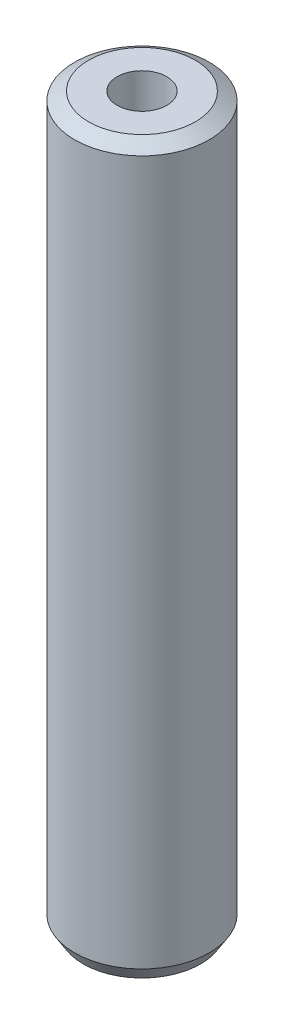
ISO-10303-21;
HEADER;
FILE_DESCRIPTION(('STEP AP214'),'2;1');
FILE_NAME('part.step','',(''),(''),'','','');
FILE_SCHEMA(('AUTOMOTIVE_DESIGN { 1 0 10303 214 1 1 1 1 }'));
ENDSEC;
DATA;
#1=APPLICATION_CONTEXT('core data for automotive mechanical design processes');
#2=APPLICATION_PROTOCOL_DEFINITION('international standard','automotive_design',2000,#1);
#3=PRODUCT_CONTEXT('',#1,'mechanical');
#4=PRODUCT('Part','Part','',(#3));
#5=PRODUCT_RELATED_PRODUCT_CATEGORY('part','',(#4));
#6=PRODUCT_DEFINITION_FORMATION('','',#4);
#7=PRODUCT_DEFINITION_CONTEXT('part definition',#1,'design');
#8=PRODUCT_DEFINITION('design','',#6,#7);
#9=PRODUCT_DEFINITION_SHAPE('','',#8);
#10=(LENGTH_UNIT() NAMED_UNIT(*) SI_UNIT(.MILLI.,.METRE.));
#11=(NAMED_UNIT(*) PLANE_ANGLE_UNIT() SI_UNIT($,.RADIAN.));
#12=(NAMED_UNIT(*) SI_UNIT($,.STERADIAN.) SOLID_ANGLE_UNIT());
#13=UNCERTAINTY_MEASURE_WITH_UNIT(LENGTH_MEASURE(1.E-05),#10,'distance_accuracy_value','');
#14=(GEOMETRIC_REPRESENTATION_CONTEXT(3) GLOBAL_UNCERTAINTY_ASSIGNED_CONTEXT((#13)) GLOBAL_UNIT_ASSIGNED_CONTEXT((#10,
#11,#12)) REPRESENTATION_CONTEXT('',''));
#15=CARTESIAN_POINT('',(0.,0.,0.));
#16=DIRECTION('',(0.,0.,1.));
#17=DIRECTION('',(1.,0.,0.));
#18=AXIS2_PLACEMENT_3D('',#15,#16,#17);
#19=CARTESIAN_POINT('',(0.,134.940841384531,0.));
#20=DIRECTION('',(0.,-1.,0.));
#21=DIRECTION('',(0.,0.,-1.));
#22=AXIS2_PLACEMENT_3D('',#19,#20,#21);
#23=CYLINDRICAL_SURFACE('',#22,12.5);
#24=CARTESIAN_POINT('',(0.,133.343333070429,0.));
#25=DIRECTION('',(0.,1.,0.));
#26=DIRECTION('',(0.,0.,1.));
#27=AXIS2_PLACEMENT_3D('',#24,#25,#26);
#28=CIRCLE('',#27,12.5);
#29=CARTESIAN_POINT('',(0.,133.343333070429,12.5));
#30=VERTEX_POINT('',#29);
#31=EDGE_CURVE('E50',#30,#30,#28,.F.);
#32=ORIENTED_EDGE('',*,*,#31,.T.);
#33=EDGE_LOOP('',(#32));
#34=FACE_BOUND('',#33,.T.);
#35=CARTESIAN_POINT('',(0.,2.58644585669401,0.));
#36=DIRECTION('',(0.,1.,0.));
#37=DIRECTION('',(0.,0.,1.));
#38=AXIS2_PLACEMENT_3D('',#35,#36,#37);
#39=CIRCLE('',#38,12.5);
#40=CARTESIAN_POINT('',(0.,2.58644585669401,12.5));
#41=VERTEX_POINT('',#40);
#42=EDGE_CURVE('E51',#41,#41,#39,.T.);
#43=ORIENTED_EDGE('',*,*,#42,.T.);
#44=EDGE_LOOP('',(#43));
#45=FACE_BOUND('',#44,.T.);
#46=ADVANCED_FACE('F39',(#34,#45),#23,.T.);
#47=CARTESIAN_POINT('',(0.,134.940841384531,0.));
#48=DIRECTION('',(0.,1.,0.));
#49=DIRECTION('',(0.,0.,1.));
#50=AXIS2_PLACEMENT_3D('',#47,#48,#49);
#51=PLANE('',#50);
#52=CARTESIAN_POINT('',(0.,134.940841384531,0.));
#53=DIRECTION('',(0.,1.,0.));
#54=DIRECTION('',(0.,0.,1.));
#55=AXIS2_PLACEMENT_3D('',#52,#53,#54);
#56=CIRCLE('',#55,9.91355414330596);
#57=CARTESIAN_POINT('',(0.,134.940841384531,9.91355414330596));
#58=VERTEX_POINT('',#57);
#59=EDGE_CURVE('E54',#58,#58,#56,.T.);
#60=ORIENTED_EDGE('',*,*,#59,.T.);
#61=EDGE_LOOP('',(#60));
#62=FACE_BOUND('',#61,.T.);
#63=CARTESIAN_POINT('',(0.,134.940841384531,0.));
#64=DIRECTION('',(0.,1.,0.));
#65=DIRECTION('',(0.,0.,1.));
#66=AXIS2_PLACEMENT_3D('',#63,#64,#65);
#67=CIRCLE('',#66,4.61707872435516);
#68=CARTESIAN_POINT('',(0.,134.940841384531,4.61707872435516));
#69=VERTEX_POINT('',#68);
#70=EDGE_CURVE('E58',#69,#69,#67,.T.);
#71=ORIENTED_EDGE('',*,*,#70,.F.);
#72=EDGE_LOOP('',(#71));
#73=FACE_BOUND('',#72,.T.);
#74=ADVANCED_FACE('F69',(#62,#73),#51,.T.);
#75=CARTESIAN_POINT('',(0.,0.,0.));
#76=DIRECTION('',(0.,1.,0.));
#77=DIRECTION('',(0.,0.,1.));
#78=AXIS2_PLACEMENT_3D('',#75,#76,#77);
#79=PLANE('',#78);
#80=CARTESIAN_POINT('',(0.,0.,0.));
#81=DIRECTION('',(0.,1.,0.));
#82=DIRECTION('',(0.,0.,1.));
#83=AXIS2_PLACEMENT_3D('',#80,#81,#82);
#84=CIRCLE('',#83,10.9024916858982);
#85=CARTESIAN_POINT('',(0.,0.,10.9024916858982));
#86=VERTEX_POINT('',#85);
#87=EDGE_CURVE('E10',#86,#86,#84,.F.);
#88=ORIENTED_EDGE('',*,*,#87,.T.);
#89=EDGE_LOOP('',(#88));
#90=FACE_BOUND('',#89,.T.);
#91=CARTESIAN_POINT('',(0.,0.,0.));
#92=DIRECTION('',(0.,1.,0.));
#93=DIRECTION('',(0.,0.,1.));
#94=AXIS2_PLACEMENT_3D('',#91,#92,#93);
#95=CIRCLE('',#94,4.61707872435516);
#96=CARTESIAN_POINT('',(0.,0.,4.61707872435516));
#97=VERTEX_POINT('',#96);
#98=EDGE_CURVE('E63',#97,#97,#95,.T.);
#99=ORIENTED_EDGE('',*,*,#98,.T.);
#100=EDGE_LOOP('',(#99));
#101=FACE_BOUND('',#100,.T.);
#102=ADVANCED_FACE('F75',(#90,#101),#79,.F.);
#103=CARTESIAN_POINT('',(0.,134.940841384531,0.));
#104=DIRECTION('',(0.,-1.,0.));
#105=DIRECTION('',(0.,0.,-1.));
#106=AXIS2_PLACEMENT_3D('',#103,#104,#105);
#107=CYLINDRICAL_SURFACE('',#106,4.61707872435516);
#108=ORIENTED_EDGE('',*,*,#70,.T.);
#109=EDGE_LOOP('',(#108));
#110=FACE_BOUND('',#109,.T.);
#111=ORIENTED_EDGE('',*,*,#98,.F.);
#112=EDGE_LOOP('',(#111));
#113=FACE_BOUND('',#112,.T.);
#114=ADVANCED_FACE('F70',(#110,#113),#107,.F.);
#115=CARTESIAN_POINT('',(0.,134.940841384531,0.));
#116=DIRECTION('',(0.,-1.,0.));
#117=DIRECTION('',(0.,0.,-1.));
#118=AXIS2_PLACEMENT_3D('',#115,#116,#117);
#119=CONICAL_SURFACE('',#118,9.91355414330596,1.01750266254107);
#120=ORIENTED_EDGE('',*,*,#31,.F.);
#121=EDGE_LOOP('',(#120));
#122=FACE_BOUND('',#121,.T.);
#123=ORIENTED_EDGE('',*,*,#59,.F.);
#124=EDGE_LOOP('',(#123));
#125=FACE_BOUND('',#124,.T.);
#126=ADVANCED_FACE('F81',(#122,#125),#119,.T.);
#127=CARTESIAN_POINT('',(0.,2.58644585669401,0.));
#128=DIRECTION('',(0.,1.,0.));
#129=DIRECTION('',(0.,0.,1.));
#130=AXIS2_PLACEMENT_3D('',#127,#128,#129);
#131=CONICAL_SURFACE('',#130,12.5,0.553293664253833);
#132=ORIENTED_EDGE('',*,*,#87,.F.);
#133=EDGE_LOOP('',(#132));
#134=FACE_BOUND('',#133,.T.);
#135=ORIENTED_EDGE('',*,*,#42,.F.);
#136=EDGE_LOOP('',(#135));
#137=FACE_BOUND('',#136,.T.);
#138=ADVANCED_FACE('F45',(#134,#137),#131,.T.);
#139=CLOSED_SHELL('',(#46,#74,#102,#114,#126,#138));
#140=MANIFOLD_SOLID_BREP('B2',#139);
#141=ADVANCED_BREP_SHAPE_REPRESENTATION('',(#18,#140),#14);
#142=SHAPE_DEFINITION_REPRESENTATION(#9,#141);
ENDSEC;
END-ISO-10303-21;
